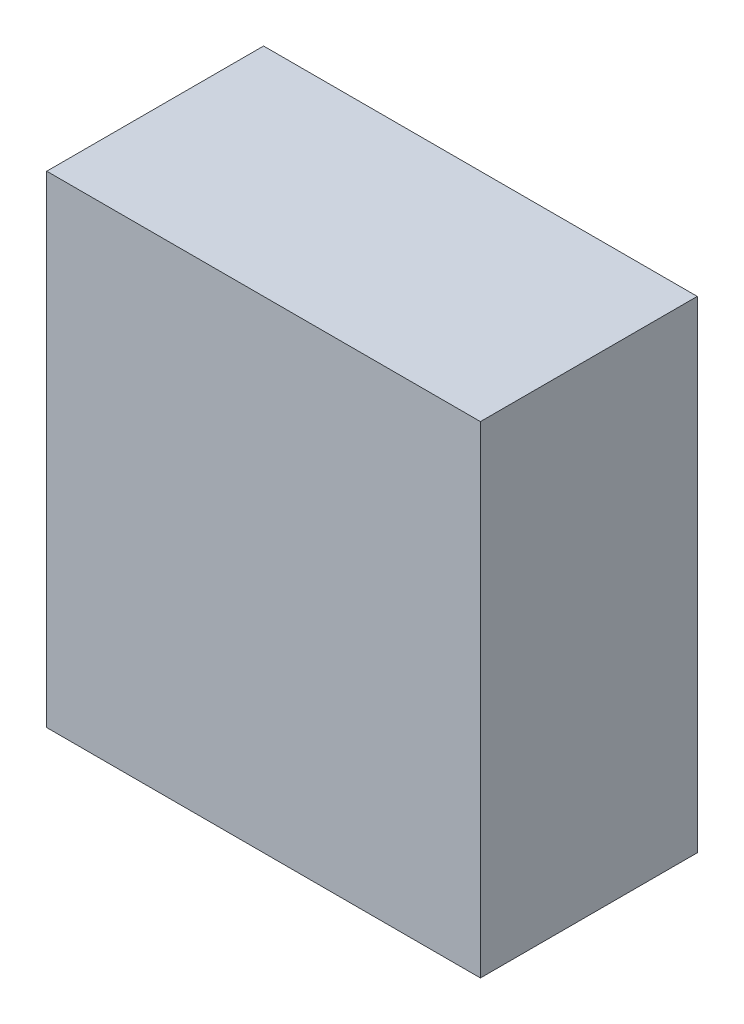
ISO-10303-21;
HEADER;
FILE_DESCRIPTION(('STEP AP214'),'2;1');
FILE_NAME('part.step','',(''),(''),'','','');
FILE_SCHEMA(('AUTOMOTIVE_DESIGN { 1 0 10303 214 1 1 1 1 }'));
ENDSEC;
DATA;
#1=APPLICATION_CONTEXT('core data for automotive mechanical design processes');
#2=APPLICATION_PROTOCOL_DEFINITION('international standard','automotive_design',2000,#1);
#3=PRODUCT_CONTEXT('',#1,'mechanical');
#4=PRODUCT('Part','Part','',(#3));
#5=PRODUCT_RELATED_PRODUCT_CATEGORY('part','',(#4));
#6=PRODUCT_DEFINITION_FORMATION('','',#4);
#7=PRODUCT_DEFINITION_CONTEXT('part definition',#1,'design');
#8=PRODUCT_DEFINITION('design','',#6,#7);
#9=PRODUCT_DEFINITION_SHAPE('','',#8);
#10=(LENGTH_UNIT() NAMED_UNIT(*) SI_UNIT(.MILLI.,.METRE.));
#11=(NAMED_UNIT(*) PLANE_ANGLE_UNIT() SI_UNIT($,.RADIAN.));
#12=(NAMED_UNIT(*) SI_UNIT($,.STERADIAN.) SOLID_ANGLE_UNIT());
#13=UNCERTAINTY_MEASURE_WITH_UNIT(LENGTH_MEASURE(1.E-05),#10,'distance_accuracy_value','');
#14=(GEOMETRIC_REPRESENTATION_CONTEXT(3) GLOBAL_UNCERTAINTY_ASSIGNED_CONTEXT((#13)) GLOBAL_UNIT_ASSIGNED_CONTEXT((#10,
#11,#12)) REPRESENTATION_CONTEXT('',''));
#15=CARTESIAN_POINT('',(0.,0.,0.));
#16=DIRECTION('',(0.,0.,1.));
#17=DIRECTION('',(1.,0.,0.));
#18=AXIS2_PLACEMENT_3D('',#15,#16,#17);
#19=CARTESIAN_POINT('',(-0.45000164,-0.499999,0.4499991));
#20=DIRECTION('',(0.,0.,-1.));
#21=DIRECTION('',(-1.,0.,0.));
#22=AXIS2_PLACEMENT_3D('',#19,#20,#21);
#23=PLANE('',#22);
#24=DIRECTION('',(0.,1.,0.));
#25=VECTOR('',#24,1.);
#26=CARTESIAN_POINT('',(0.45000164,-0.499999,0.4499991));
#27=LINE('',#26,#25);
#28=CARTESIAN_POINT('',(0.45000164,-0.499999,0.4499991));
#29=VERTEX_POINT('',#28);
#30=CARTESIAN_POINT('',(0.45000164,0.499999,0.4499991));
#31=VERTEX_POINT('',#30);
#32=EDGE_CURVE('E54',#29,#31,#27,.T.);
#33=ORIENTED_EDGE('',*,*,#32,.T.);
#34=DIRECTION('',(1.,0.,0.));
#35=VECTOR('',#34,1.);
#36=CARTESIAN_POINT('',(0.45000164,0.499999,0.4499991));
#37=LINE('',#36,#35);
#38=CARTESIAN_POINT('',(-0.45000164,0.499999,0.4499991));
#39=VERTEX_POINT('',#38);
#40=EDGE_CURVE('E56',#31,#39,#37,.F.);
#41=ORIENTED_EDGE('',*,*,#40,.T.);
#42=DIRECTION('',(0.,1.,0.));
#43=VECTOR('',#42,1.);
#44=CARTESIAN_POINT('',(-0.45000164,0.499999,0.4499991));
#45=LINE('',#44,#43);
#46=CARTESIAN_POINT('',(-0.45000164,-0.499999,0.4499991));
#47=VERTEX_POINT('',#46);
#48=EDGE_CURVE('E19',#39,#47,#45,.F.);
#49=ORIENTED_EDGE('',*,*,#48,.T.);
#50=DIRECTION('',(1.,0.,0.));
#51=VECTOR('',#50,1.);
#52=CARTESIAN_POINT('',(-0.45000164,-0.499999,0.4499991));
#53=LINE('',#52,#51);
#54=EDGE_CURVE('E79',#47,#29,#53,.T.);
#55=ORIENTED_EDGE('',*,*,#54,.T.);
#56=EDGE_LOOP('',(#33,#41,#49,#55));
#57=FACE_BOUND('',#56,.T.);
#58=ADVANCED_FACE('F16',(#57),#23,.F.);
#59=CARTESIAN_POINT('',(-0.45000164,0.499999,0.));
#60=DIRECTION('',(1.,0.,0.));
#61=DIRECTION('',(0.,0.,-1.));
#62=AXIS2_PLACEMENT_3D('',#59,#60,#61);
#63=PLANE('',#62);
#64=DIRECTION('',(0.,0.,1.));
#65=VECTOR('',#64,1.);
#66=CARTESIAN_POINT('',(-0.45000164,-0.499999,0.));
#67=LINE('',#66,#65);
#68=CARTESIAN_POINT('',(-0.45000164,-0.499999,0.));
#69=VERTEX_POINT('',#68);
#70=EDGE_CURVE('E67',#69,#47,#67,.T.);
#71=ORIENTED_EDGE('',*,*,#70,.T.);
#72=ORIENTED_EDGE('',*,*,#48,.F.);
#73=DIRECTION('',(0.,0.,-1.));
#74=VECTOR('',#73,1.);
#75=CARTESIAN_POINT('',(-0.45000164,0.499999,0.));
#76=LINE('',#75,#74);
#77=CARTESIAN_POINT('',(-0.45000164,0.499999,0.));
#78=VERTEX_POINT('',#77);
#79=EDGE_CURVE('E62',#39,#78,#76,.T.);
#80=ORIENTED_EDGE('',*,*,#79,.T.);
#81=DIRECTION('',(0.,1.,0.));
#82=VECTOR('',#81,1.);
#83=CARTESIAN_POINT('',(-0.45000164,-0.499999,0.));
#84=LINE('',#83,#82);
#85=EDGE_CURVE('E82',#69,#78,#84,.T.);
#86=ORIENTED_EDGE('',*,*,#85,.F.);
#87=EDGE_LOOP('',(#71,#72,#80,#86));
#88=FACE_BOUND('',#87,.T.);
#89=ADVANCED_FACE('F64',(#88),#63,.F.);
#90=CARTESIAN_POINT('',(0.45000164,0.499999,0.));
#91=DIRECTION('',(0.,-1.,0.));
#92=DIRECTION('',(0.,0.,-1.));
#93=AXIS2_PLACEMENT_3D('',#90,#91,#92);
#94=PLANE('',#93);
#95=ORIENTED_EDGE('',*,*,#79,.F.);
#96=ORIENTED_EDGE('',*,*,#40,.F.);
#97=DIRECTION('',(0.,0.,1.));
#98=VECTOR('',#97,1.);
#99=CARTESIAN_POINT('',(0.45000164,0.499999,0.));
#100=LINE('',#99,#98);
#101=CARTESIAN_POINT('',(0.45000164,0.499999,0.));
#102=VERTEX_POINT('',#101);
#103=EDGE_CURVE('E74',#31,#102,#100,.F.);
#104=ORIENTED_EDGE('',*,*,#103,.T.);
#105=DIRECTION('',(-1.,0.,0.));
#106=VECTOR('',#105,1.);
#107=CARTESIAN_POINT('',(-0.45000164,0.499999,0.));
#108=LINE('',#107,#106);
#109=EDGE_CURVE('E71',#78,#102,#108,.F.);
#110=ORIENTED_EDGE('',*,*,#109,.F.);
#111=EDGE_LOOP('',(#95,#96,#104,#110));
#112=FACE_BOUND('',#111,.T.);
#113=ADVANCED_FACE('F69',(#112),#94,.F.);
#114=CARTESIAN_POINT('',(0.45000164,-0.499999,0.));
#115=DIRECTION('',(-1.,0.,0.));
#116=DIRECTION('',(0.,0.,1.));
#117=AXIS2_PLACEMENT_3D('',#114,#115,#116);
#118=PLANE('',#117);
#119=ORIENTED_EDGE('',*,*,#103,.F.);
#120=ORIENTED_EDGE('',*,*,#32,.F.);
#121=DIRECTION('',(0.,0.,1.));
#122=VECTOR('',#121,1.);
#123=CARTESIAN_POINT('',(0.45000164,-0.499999,0.));
#124=LINE('',#123,#122);
#125=CARTESIAN_POINT('',(0.45000164,-0.499999,0.));
#126=VERTEX_POINT('',#125);
#127=EDGE_CURVE('E34',#29,#126,#124,.F.);
#128=ORIENTED_EDGE('',*,*,#127,.T.);
#129=DIRECTION('',(0.,1.,0.));
#130=VECTOR('',#129,1.);
#131=CARTESIAN_POINT('',(0.45000164,-0.499999,0.));
#132=LINE('',#131,#130);
#133=EDGE_CURVE('E25',#102,#126,#132,.F.);
#134=ORIENTED_EDGE('',*,*,#133,.F.);
#135=EDGE_LOOP('',(#119,#120,#128,#134));
#136=FACE_BOUND('',#135,.T.);
#137=ADVANCED_FACE('F88',(#136),#118,.F.);
#138=CARTESIAN_POINT('',(-0.45000164,-0.499999,0.));
#139=DIRECTION('',(0.,1.,0.));
#140=DIRECTION('',(0.,0.,1.));
#141=AXIS2_PLACEMENT_3D('',#138,#139,#140);
#142=PLANE('',#141);
#143=ORIENTED_EDGE('',*,*,#127,.F.);
#144=ORIENTED_EDGE('',*,*,#54,.F.);
#145=ORIENTED_EDGE('',*,*,#70,.F.);
#146=DIRECTION('',(-1.,0.,0.));
#147=VECTOR('',#146,1.);
#148=CARTESIAN_POINT('',(-0.45000164,-0.499999,0.));
#149=LINE('',#148,#147);
#150=EDGE_CURVE('E11',#126,#69,#149,.T.);
#151=ORIENTED_EDGE('',*,*,#150,.F.);
#152=EDGE_LOOP('',(#143,#144,#145,#151));
#153=FACE_BOUND('',#152,.T.);
#154=ADVANCED_FACE('F90',(#153),#142,.F.);
#155=CARTESIAN_POINT('',(-0.45000164,-0.499999,0.));
#156=DIRECTION('',(0.,0.,-1.));
#157=DIRECTION('',(-1.,0.,0.));
#158=AXIS2_PLACEMENT_3D('',#155,#156,#157);
#159=PLANE('',#158);
#160=ORIENTED_EDGE('',*,*,#133,.T.);
#161=ORIENTED_EDGE('',*,*,#150,.T.);
#162=ORIENTED_EDGE('',*,*,#85,.T.);
#163=ORIENTED_EDGE('',*,*,#109,.T.);
#164=EDGE_LOOP('',(#160,#161,#162,#163));
#165=FACE_BOUND('',#164,.T.);
#166=ADVANCED_FACE('F87',(#165),#159,.T.);
#167=CLOSED_SHELL('',(#58,#89,#113,#137,#154,#166));
#168=MANIFOLD_SOLID_BREP('B1',#167);
#169=ADVANCED_BREP_SHAPE_REPRESENTATION('',(#18,#168),#14);
#170=SHAPE_DEFINITION_REPRESENTATION(#9,#169);
ENDSEC;
END-ISO-10303-21;
